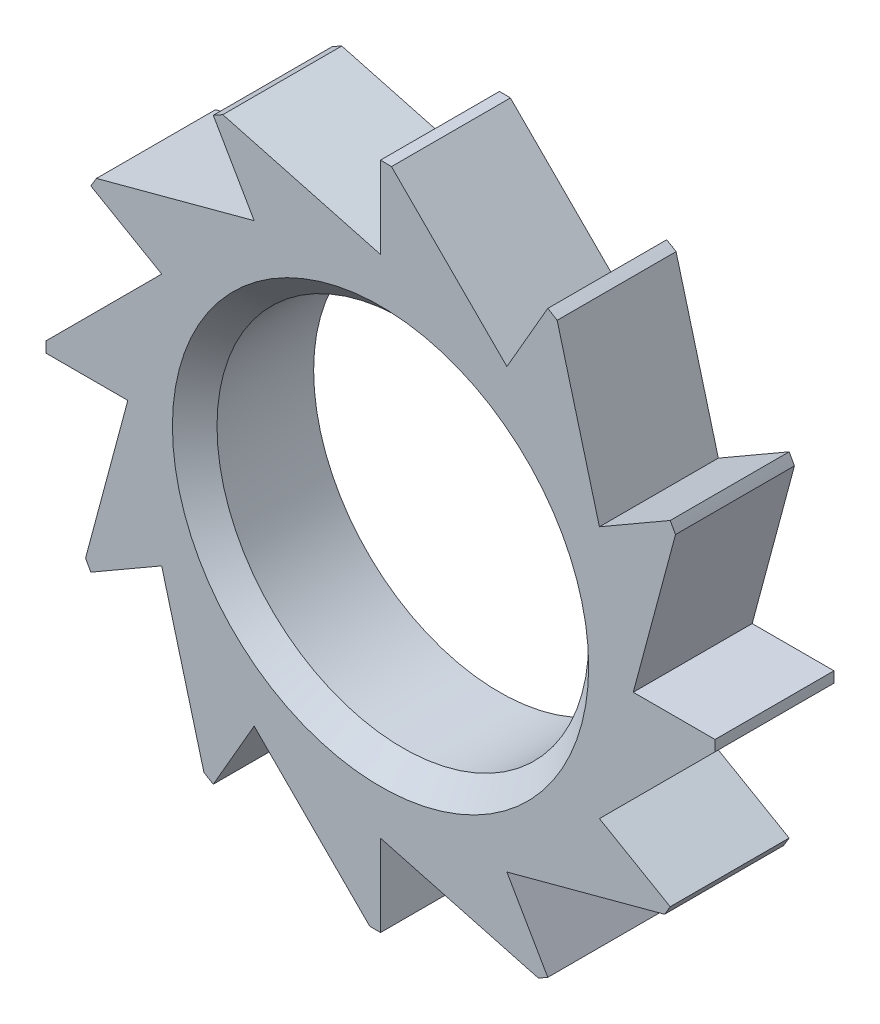
ISO-10303-21;
HEADER;
FILE_DESCRIPTION(('STEP AP214'),'2;1');
FILE_NAME('part.step','',(''),(''),'','','');
FILE_SCHEMA(('AUTOMOTIVE_DESIGN { 1 0 10303 214 1 1 1 1 }'));
ENDSEC;
DATA;
#1=APPLICATION_CONTEXT('core data for automotive mechanical design processes');
#2=APPLICATION_PROTOCOL_DEFINITION('international standard','automotive_design',2000,#1);
#3=PRODUCT_CONTEXT('',#1,'mechanical');
#4=PRODUCT('Part','Part','',(#3));
#5=PRODUCT_RELATED_PRODUCT_CATEGORY('part','',(#4));
#6=PRODUCT_DEFINITION_FORMATION('','',#4);
#7=PRODUCT_DEFINITION_CONTEXT('part definition',#1,'design');
#8=PRODUCT_DEFINITION('design','',#6,#7);
#9=PRODUCT_DEFINITION_SHAPE('','',#8);
#10=(LENGTH_UNIT() NAMED_UNIT(*) SI_UNIT(.MILLI.,.METRE.));
#11=(NAMED_UNIT(*) PLANE_ANGLE_UNIT() SI_UNIT($,.RADIAN.));
#12=(NAMED_UNIT(*) SI_UNIT($,.STERADIAN.) SOLID_ANGLE_UNIT());
#13=UNCERTAINTY_MEASURE_WITH_UNIT(LENGTH_MEASURE(1.E-05),#10,'distance_accuracy_value','');
#14=(GEOMETRIC_REPRESENTATION_CONTEXT(3) GLOBAL_UNCERTAINTY_ASSIGNED_CONTEXT((#13)) GLOBAL_UNIT_ASSIGNED_CONTEXT((#10,
#11,#12)) REPRESENTATION_CONTEXT('',''));
#15=CARTESIAN_POINT('',(0.,0.,0.));
#16=DIRECTION('',(0.,0.,1.));
#17=DIRECTION('',(1.,0.,0.));
#18=AXIS2_PLACEMENT_3D('',#15,#16,#17);
#19=CARTESIAN_POINT('',(0.,0.,8.));
#20=DIRECTION('',(0.,0.,-1.));
#21=DIRECTION('',(-1.,0.,0.));
#22=AXIS2_PLACEMENT_3D('',#19,#20,#21);
#23=CYLINDRICAL_SURFACE('',#22,45.);
#24=CARTESIAN_POINT('',(0.,0.,-8.));
#25=DIRECTION('',(0.,0.,1.));
#26=DIRECTION('',(1.,0.,0.));
#27=AXIS2_PLACEMENT_3D('',#24,#25,#26);
#28=CIRCLE('',#27,45.);
#29=CARTESIAN_POINT('',(-23.7600654655657,-38.2159559486876,-8.00000625));
#30=VERTEX_POINT('',#29);
#31=CARTESIAN_POINT('',(-22.4999999999998,-38.9711431702999,-8.00000625));
#32=VERTEX_POINT('',#31);
#33=EDGE_CURVE('E523',#30,#32,#28,.T.);
#34=ORIENTED_EDGE('',*,*,#33,.T.);
#35=DIRECTION('',(0.,0.,-1.));
#36=VECTOR('',#35,1.);
#37=CARTESIAN_POINT('',(-22.4999999999998,-38.9711431702999,8.));
#38=LINE('',#37,#36);
#39=CARTESIAN_POINT('',(-22.4999999999998,-38.9711431702999,8.));
#40=VERTEX_POINT('',#39);
#41=EDGE_CURVE('E11',#32,#40,#38,.F.);
#42=ORIENTED_EDGE('',*,*,#41,.T.);
#43=CARTESIAN_POINT('',(0.,0.,8.));
#44=DIRECTION('',(0.,0.,1.));
#45=DIRECTION('',(1.,0.,0.));
#46=AXIS2_PLACEMENT_3D('',#43,#44,#45);
#47=CIRCLE('',#46,45.);
#48=CARTESIAN_POINT('',(-23.7600654655657,-38.2159559486876,8.));
#49=VERTEX_POINT('',#48);
#50=EDGE_CURVE('E759',#49,#40,#47,.T.);
#51=ORIENTED_EDGE('',*,*,#50,.F.);
#52=DIRECTION('',(0.,0.,-1.));
#53=VECTOR('',#52,1.);
#54=CARTESIAN_POINT('',(-23.7600654655657,-38.2159559486876,8.));
#55=LINE('',#54,#53);
#56=EDGE_CURVE('E530',#49,#30,#55,.T.);
#57=ORIENTED_EDGE('',*,*,#56,.T.);
#58=EDGE_LOOP('',(#34,#42,#51,#57));
#59=FACE_BOUND('',#58,.T.);
#60=ADVANCED_FACE('F45',(#59),#23,.T.);
#61=CARTESIAN_POINT('',(-39.6847982631051,-21.2159559486876,-8.00000625));
#62=VERTEX_POINT('',#61);
#63=CARTESIAN_POINT('',(-38.9711431702996,-22.5000000000002,-8.00000625));
#64=VERTEX_POINT('',#63);
#65=EDGE_CURVE('E518',#62,#64,#28,.T.);
#66=ORIENTED_EDGE('',*,*,#65,.T.);
#67=DIRECTION('',(0.,0.,-1.));
#68=VECTOR('',#67,1.);
#69=CARTESIAN_POINT('',(-38.9711431702996,-22.5000000000002,8.));
#70=LINE('',#69,#68);
#71=CARTESIAN_POINT('',(-38.9711431702996,-22.5000000000002,8.));
#72=VERTEX_POINT('',#71);
#73=EDGE_CURVE('E537',#64,#72,#70,.F.);
#74=ORIENTED_EDGE('',*,*,#73,.T.);
#75=CARTESIAN_POINT('',(-39.6847982631051,-21.2159559486876,8.));
#76=VERTEX_POINT('',#75);
#77=EDGE_CURVE('E756',#76,#72,#47,.T.);
#78=ORIENTED_EDGE('',*,*,#77,.F.);
#79=DIRECTION('',(0.,0.,-1.));
#80=VECTOR('',#79,1.);
#81=CARTESIAN_POINT('',(-39.6847982631051,-21.2159559486876,8.));
#82=LINE('',#81,#80);
#83=EDGE_CURVE('E531',#76,#62,#82,.T.);
#84=ORIENTED_EDGE('',*,*,#83,.T.);
#85=EDGE_LOOP('',(#66,#74,#78,#84));
#86=FACE_BOUND('',#85,.T.);
#87=ADVANCED_FACE('F822',(#86),#23,.T.);
#88=CARTESIAN_POINT('',(-44.9760214142533,1.46884231441758,-8.00000625));
#89=VERTEX_POINT('',#88);
#90=CARTESIAN_POINT('',(-45.,-1.57116660247941E-13,-8.00000625));
#91=VERTEX_POINT('',#90);
#92=EDGE_CURVE('E463',#89,#91,#28,.T.);
#93=ORIENTED_EDGE('',*,*,#92,.T.);
#94=DIRECTION('',(0.,0.,-1.));
#95=VECTOR('',#94,1.);
#96=CARTESIAN_POINT('',(-45.,-1.57116660247941E-13,8.));
#97=LINE('',#96,#95);
#98=CARTESIAN_POINT('',(-45.,-1.57116660247941E-13,8.));
#99=VERTEX_POINT('',#98);
#100=EDGE_CURVE('E526',#91,#99,#97,.F.);
#101=ORIENTED_EDGE('',*,*,#100,.T.);
#102=CARTESIAN_POINT('',(-44.9760214142534,1.46884231441758,8.));
#103=VERTEX_POINT('',#102);
#104=EDGE_CURVE('E753',#103,#99,#47,.T.);
#105=ORIENTED_EDGE('',*,*,#104,.F.);
#106=DIRECTION('',(0.,0.,-1.));
#107=VECTOR('',#106,1.);
#108=CARTESIAN_POINT('',(-44.9760214142533,1.46884231441758,8.));
#109=LINE('',#108,#107);
#110=EDGE_CURVE('E896',#103,#89,#109,.T.);
#111=ORIENTED_EDGE('',*,*,#110,.T.);
#112=EDGE_LOOP('',(#93,#101,#105,#111));
#113=FACE_BOUND('',#112,.T.);
#114=ADVANCED_FACE('F827',(#113),#23,.T.);
#115=CARTESIAN_POINT('',(-38.2159559486875,23.7600654655659,-8.00000625));
#116=VERTEX_POINT('',#115);
#117=CARTESIAN_POINT('',(-38.9711431702998,22.4999999999999,-8.00000625));
#118=VERTEX_POINT('',#117);
#119=EDGE_CURVE('E312',#116,#118,#28,.T.);
#120=ORIENTED_EDGE('',*,*,#119,.T.);
#121=DIRECTION('',(0.,0.,-1.));
#122=VECTOR('',#121,1.);
#123=CARTESIAN_POINT('',(-38.9711431702998,22.4999999999999,8.));
#124=LINE('',#123,#122);
#125=CARTESIAN_POINT('',(-38.9711431702998,22.4999999999999,8.));
#126=VERTEX_POINT('',#125);
#127=EDGE_CURVE('E905',#118,#126,#124,.F.);
#128=ORIENTED_EDGE('',*,*,#127,.T.);
#129=CARTESIAN_POINT('',(-38.2159559486875,23.7600654655659,8.));
#130=VERTEX_POINT('',#129);
#131=EDGE_CURVE('E750',#130,#126,#47,.T.);
#132=ORIENTED_EDGE('',*,*,#131,.F.);
#133=DIRECTION('',(0.,0.,-1.));
#134=VECTOR('',#133,1.);
#135=CARTESIAN_POINT('',(-38.2159559486875,23.7600654655659,8.));
#136=LINE('',#135,#134);
#137=EDGE_CURVE('E453',#130,#116,#136,.T.);
#138=ORIENTED_EDGE('',*,*,#137,.T.);
#139=EDGE_LOOP('',(#120,#128,#132,#138));
#140=FACE_BOUND('',#139,.T.);
#141=ADVANCED_FACE('F1196',(#140),#23,.T.);
#142=CARTESIAN_POINT('',(21.2159559486874,-39.6847982631052,-8.00000625));
#143=VERTEX_POINT('',#142);
#144=CARTESIAN_POINT('',(22.5000000000003,-38.9711431702996,-8.00000625));
#145=VERTEX_POINT('',#144);
#146=EDGE_CURVE('E506',#143,#145,#28,.T.);
#147=ORIENTED_EDGE('',*,*,#146,.T.);
#148=DIRECTION('',(0.,0.,-1.));
#149=VECTOR('',#148,1.);
#150=CARTESIAN_POINT('',(22.5000000000003,-38.9711431702996,8.));
#151=LINE('',#150,#149);
#152=CARTESIAN_POINT('',(22.5000000000003,-38.9711431702996,8.));
#153=VERTEX_POINT('',#152);
#154=EDGE_CURVE('E893',#145,#153,#151,.F.);
#155=ORIENTED_EDGE('',*,*,#154,.T.);
#156=CARTESIAN_POINT('',(21.2159559486874,-39.6847982631052,8.));
#157=VERTEX_POINT('',#156);
#158=EDGE_CURVE('E764',#157,#153,#47,.T.);
#159=ORIENTED_EDGE('',*,*,#158,.F.);
#160=DIRECTION('',(0.,0.,-1.));
#161=VECTOR('',#160,1.);
#162=CARTESIAN_POINT('',(21.2159559486874,-39.6847982631052,8.));
#163=LINE('',#162,#161);
#164=EDGE_CURVE('E882',#157,#143,#163,.T.);
#165=ORIENTED_EDGE('',*,*,#164,.T.);
#166=EDGE_LOOP('',(#147,#155,#159,#165));
#167=FACE_BOUND('',#166,.T.);
#168=ADVANCED_FACE('F1204',(#167),#23,.T.);
#169=CARTESIAN_POINT('',(-1.46884231441742,-44.9760214142534,8.));
#170=VERTEX_POINT('',#169);
#171=CARTESIAN_POINT('',(0.,-45.,8.));
#172=VERTEX_POINT('',#171);
#173=EDGE_CURVE('E558',#170,#172,#47,.T.);
#174=ORIENTED_EDGE('',*,*,#173,.F.);
#175=DIRECTION('',(0.,0.,-1.));
#176=VECTOR('',#175,1.);
#177=CARTESIAN_POINT('',(-1.46884231441743,-44.9760214142533,8.));
#178=LINE('',#177,#176);
#179=CARTESIAN_POINT('',(-1.46884231441742,-44.9760214142534,-8.00000625));
#180=VERTEX_POINT('',#179);
#181=EDGE_CURVE('E56',#170,#180,#178,.T.);
#182=ORIENTED_EDGE('',*,*,#181,.T.);
#183=CARTESIAN_POINT('',(0.,-45.,-8.00000625));
#184=VERTEX_POINT('',#183);
#185=EDGE_CURVE('E511',#180,#184,#28,.T.);
#186=ORIENTED_EDGE('',*,*,#185,.T.);
#187=DIRECTION('',(0.,0.,-1.));
#188=VECTOR('',#187,1.);
#189=CARTESIAN_POINT('',(0.,-45.,8.));
#190=LINE('',#189,#188);
#191=EDGE_CURVE('E888',#184,#172,#190,.F.);
#192=ORIENTED_EDGE('',*,*,#191,.T.);
#193=EDGE_LOOP('',(#174,#182,#186,#192));
#194=FACE_BOUND('',#193,.T.);
#195=ADVANCED_FACE('F555',(#194),#23,.T.);
#196=CARTESIAN_POINT('',(38.2159559486877,-23.7600654655656,8.));
#197=VERTEX_POINT('',#196);
#198=CARTESIAN_POINT('',(38.9711431702999,-22.4999999999996,8.));
#199=VERTEX_POINT('',#198);
#200=EDGE_CURVE('E739',#197,#199,#47,.T.);
#201=ORIENTED_EDGE('',*,*,#200,.F.);
#202=DIRECTION('',(0.,0.,-1.));
#203=VECTOR('',#202,1.);
#204=CARTESIAN_POINT('',(38.2159559486877,-23.7600654655656,8.));
#205=LINE('',#204,#203);
#206=CARTESIAN_POINT('',(38.2159559486877,-23.7600654655656,-8.00000625));
#207=VERTEX_POINT('',#206);
#208=EDGE_CURVE('E890',#197,#207,#205,.T.);
#209=ORIENTED_EDGE('',*,*,#208,.T.);
#210=CARTESIAN_POINT('',(38.9711431702999,-22.4999999999996,-8.00000625));
#211=VERTEX_POINT('',#210);
#212=EDGE_CURVE('E501',#207,#211,#28,.T.);
#213=ORIENTED_EDGE('',*,*,#212,.T.);
#214=DIRECTION('',(0.,0.,-1.));
#215=VECTOR('',#214,1.);
#216=CARTESIAN_POINT('',(38.9711431702999,-22.4999999999996,8.));
#217=LINE('',#216,#215);
#218=EDGE_CURVE('E880',#211,#199,#217,.F.);
#219=ORIENTED_EDGE('',*,*,#218,.T.);
#220=EDGE_LOOP('',(#201,#209,#213,#219));
#221=FACE_BOUND('',#220,.T.);
#222=ADVANCED_FACE('F1221',(#221),#23,.T.);
#223=CARTESIAN_POINT('',(44.9760214142534,-1.46884231441726,8.));
#224=VERTEX_POINT('',#223);
#225=CARTESIAN_POINT('',(45.,4.71349980743823E-13,8.));
#226=VERTEX_POINT('',#225);
#227=EDGE_CURVE('E733',#224,#226,#47,.T.);
#228=ORIENTED_EDGE('',*,*,#227,.F.);
#229=DIRECTION('',(0.,0.,-1.));
#230=VECTOR('',#229,1.);
#231=CARTESIAN_POINT('',(44.9760214142534,-1.46884231441727,8.));
#232=LINE('',#231,#230);
#233=CARTESIAN_POINT('',(44.9760214142534,-1.46884231441727,-8.00000625));
#234=VERTEX_POINT('',#233);
#235=EDGE_CURVE('E873',#224,#234,#232,.T.);
#236=ORIENTED_EDGE('',*,*,#235,.T.);
#237=CARTESIAN_POINT('',(45.,4.71349980743823E-13,-8.00000625));
#238=VERTEX_POINT('',#237);
#239=EDGE_CURVE('E496',#234,#238,#28,.T.);
#240=ORIENTED_EDGE('',*,*,#239,.T.);
#241=DIRECTION('',(0.,0.,-1.));
#242=VECTOR('',#241,1.);
#243=CARTESIAN_POINT('',(45.,4.71349980743823E-13,8.));
#244=LINE('',#243,#242);
#245=EDGE_CURVE('E871',#238,#226,#244,.F.);
#246=ORIENTED_EDGE('',*,*,#245,.T.);
#247=EDGE_LOOP('',(#228,#236,#240,#246));
#248=FACE_BOUND('',#247,.T.);
#249=ADVANCED_FACE('F1230',(#248),#23,.T.);
#250=CARTESIAN_POINT('',(39.6847982631049,21.2159559486878,8.));
#251=VERTEX_POINT('',#250);
#252=CARTESIAN_POINT('',(38.9711431702995,22.5000000000005,8.));
#253=VERTEX_POINT('',#252);
#254=EDGE_CURVE('E730',#251,#253,#47,.T.);
#255=ORIENTED_EDGE('',*,*,#254,.F.);
#256=DIRECTION('',(0.,0.,-1.));
#257=VECTOR('',#256,1.);
#258=CARTESIAN_POINT('',(39.6847982631049,21.2159559486878,8.));
#259=LINE('',#258,#257);
#260=CARTESIAN_POINT('',(39.6847982631049,21.2159559486878,-8.00000625));
#261=VERTEX_POINT('',#260);
#262=EDGE_CURVE('E865',#251,#261,#259,.T.);
#263=ORIENTED_EDGE('',*,*,#262,.T.);
#264=CARTESIAN_POINT('',(38.9711431702995,22.5000000000005,-8.00000625));
#265=VERTEX_POINT('',#264);
#266=EDGE_CURVE('E491',#261,#265,#28,.T.);
#267=ORIENTED_EDGE('',*,*,#266,.T.);
#268=DIRECTION('',(0.,0.,-1.));
#269=VECTOR('',#268,1.);
#270=CARTESIAN_POINT('',(38.9711431702995,22.5000000000004,8.));
#271=LINE('',#270,#269);
#272=EDGE_CURVE('E862',#265,#253,#271,.F.);
#273=ORIENTED_EDGE('',*,*,#272,.T.);
#274=EDGE_LOOP('',(#255,#263,#267,#273));
#275=FACE_BOUND('',#274,.T.);
#276=ADVANCED_FACE('F844',(#275),#23,.T.);
#277=CARTESIAN_POINT('',(23.7600654655655,38.2159559486877,8.));
#278=VERTEX_POINT('',#277);
#279=CARTESIAN_POINT('',(22.4999999999995,38.9711431703,8.));
#280=VERTEX_POINT('',#279);
#281=EDGE_CURVE('E734',#278,#280,#47,.T.);
#282=ORIENTED_EDGE('',*,*,#281,.F.);
#283=DIRECTION('',(0.,0.,-1.));
#284=VECTOR('',#283,1.);
#285=CARTESIAN_POINT('',(23.7600654655655,38.2159559486877,8.));
#286=LINE('',#285,#284);
#287=CARTESIAN_POINT('',(23.7600654655655,38.2159559486877,-8.00000625));
#288=VERTEX_POINT('',#287);
#289=EDGE_CURVE('E859',#278,#288,#286,.T.);
#290=ORIENTED_EDGE('',*,*,#289,.T.);
#291=CARTESIAN_POINT('',(22.4999999999995,38.9711431703,-8.00000625));
#292=VERTEX_POINT('',#291);
#293=EDGE_CURVE('E486',#288,#292,#28,.T.);
#294=ORIENTED_EDGE('',*,*,#293,.T.);
#295=DIRECTION('',(0.,0.,-1.));
#296=VECTOR('',#295,1.);
#297=CARTESIAN_POINT('',(22.4999999999995,38.9711431703,8.));
#298=LINE('',#297,#296);
#299=EDGE_CURVE('E854',#292,#280,#298,.F.);
#300=ORIENTED_EDGE('',*,*,#299,.T.);
#301=EDGE_LOOP('',(#282,#290,#294,#300));
#302=FACE_BOUND('',#301,.T.);
#303=ADVANCED_FACE('F837',(#302),#23,.T.);
#304=CARTESIAN_POINT('',(-21.2159559486874,39.6847982631052,-8.));
#305=VERTEX_POINT('',#304);
#306=CARTESIAN_POINT('',(-22.5,38.9711431702997,-8.00000625));
#307=VERTEX_POINT('',#306);
#308=EDGE_CURVE('E462',#305,#307,#28,.T.);
#309=ORIENTED_EDGE('',*,*,#308,.T.);
#310=DIRECTION('',(0.,0.,-1.));
#311=VECTOR('',#310,1.);
#312=CARTESIAN_POINT('',(-22.5,38.9711431702997,8.));
#313=LINE('',#312,#311);
#314=CARTESIAN_POINT('',(-22.5,38.9711431702997,8.));
#315=VERTEX_POINT('',#314);
#316=EDGE_CURVE('E289',#307,#315,#313,.F.);
#317=ORIENTED_EDGE('',*,*,#316,.T.);
#318=CARTESIAN_POINT('',(-21.2159559486874,39.6847982631052,8.));
#319=VERTEX_POINT('',#318);
#320=EDGE_CURVE('E744',#319,#315,#47,.T.);
#321=ORIENTED_EDGE('',*,*,#320,.F.);
#322=DIRECTION('',(0.,0.,1.));
#323=VECTOR('',#322,1.);
#324=CARTESIAN_POINT('',(-21.2159559486874,39.6847982631052,-8.));
#325=LINE('',#324,#323);
#326=EDGE_CURVE('E617',#305,#319,#325,.T.);
#327=ORIENTED_EDGE('',*,*,#326,.F.);
#328=EDGE_LOOP('',(#309,#317,#321,#327));
#329=FACE_BOUND('',#328,.T.);
#330=ADVANCED_FACE('F831',(#329),#23,.T.);
#331=CARTESIAN_POINT('',(0.,0.,8.));
#332=DIRECTION('',(0.,0.,1.));
#333=DIRECTION('',(1.,0.,0.));
#334=AXIS2_PLACEMENT_3D('',#331,#332,#333);
#335=PLANE('',#334);
#336=DIRECTION('',(-0.499999999999995,-0.866025403784442,0.));
#337=VECTOR('',#336,1.);
#338=CARTESIAN_POINT('',(0.,0.,8.));
#339=LINE('',#338,#337);
#340=CARTESIAN_POINT('',(-16.9999999999998,-29.444863728671,8.));
#341=VERTEX_POINT('',#340);
#342=EDGE_CURVE('E319',#341,#40,#339,.T.);
#343=ORIENTED_EDGE('',*,*,#342,.F.);
#344=DIRECTION('',(-0.707106781186549,0.707106781186546,0.));
#345=VECTOR('',#344,1.);
#346=CARTESIAN_POINT('',(-23.2224318643354,-23.2224318643355,8.));
#347=LINE('',#346,#345);
#348=EDGE_CURVE('E446',#170,#341,#347,.T.);
#349=ORIENTED_EDGE('',*,*,#348,.F.);
#350=ORIENTED_EDGE('',*,*,#173,.T.);
#351=DIRECTION('',(0.,-1.,0.));
#352=VECTOR('',#351,1.);
#353=CARTESIAN_POINT('',(0.,0.,8.));
#354=LINE('',#353,#352);
#355=CARTESIAN_POINT('',(0.,-34.,8.));
#356=VERTEX_POINT('',#355);
#357=EDGE_CURVE('E391',#356,#172,#354,.T.);
#358=ORIENTED_EDGE('',*,*,#357,.F.);
#359=DIRECTION('',(-0.965925826289067,0.258819045102525,0.));
#360=VECTOR('',#359,1.);
#361=CARTESIAN_POINT('',(-8.50000000000012,-31.7224318643354,8.));
#362=LINE('',#361,#360);
#363=EDGE_CURVE('E385',#157,#356,#362,.T.);
#364=ORIENTED_EDGE('',*,*,#363,.F.);
#365=ORIENTED_EDGE('',*,*,#158,.T.);
#366=DIRECTION('',(0.500000000000007,-0.866025403784434,0.));
#367=VECTOR('',#366,1.);
#368=CARTESIAN_POINT('',(0.,0.,8.));
#369=LINE('',#368,#367);
#370=CARTESIAN_POINT('',(17.0000000000002,-29.4448637286708,8.));
#371=VERTEX_POINT('',#370);
#372=EDGE_CURVE('E412',#371,#153,#369,.T.);
#373=ORIENTED_EDGE('',*,*,#372,.F.);
#374=DIRECTION('',(-0.965925826289067,-0.258819045102525,0.));
#375=VECTOR('',#374,1.);
#376=CARTESIAN_POINT('',(8.50000000000012,-31.7224318643354,8.));
#377=LINE('',#376,#375);
#378=EDGE_CURVE('E396',#197,#371,#377,.T.);
#379=ORIENTED_EDGE('',*,*,#378,.F.);
#380=ORIENTED_EDGE('',*,*,#200,.T.);
#381=DIRECTION('',(0.866025403784443,-0.499999999999992,0.));
#382=VECTOR('',#381,1.);
#383=CARTESIAN_POINT('',(0.,0.,8.));
#384=LINE('',#383,#382);
#385=CARTESIAN_POINT('',(29.4448637286711,-16.9999999999997,8.));
#386=VERTEX_POINT('',#385);
#387=EDGE_CURVE('E386',#386,#199,#384,.T.);
#388=ORIENTED_EDGE('',*,*,#387,.F.);
#389=DIRECTION('',(-0.707106781186544,-0.707106781186551,0.));
#390=VECTOR('',#389,1.);
#391=CARTESIAN_POINT('',(23.2224318643355,-23.2224318643353,8.));
#392=LINE('',#391,#390);
#393=EDGE_CURVE('E370',#224,#386,#392,.T.);
#394=ORIENTED_EDGE('',*,*,#393,.F.);
#395=ORIENTED_EDGE('',*,*,#227,.T.);
#396=DIRECTION('',(1.,0.,0.));
#397=VECTOR('',#396,1.);
#398=CARTESIAN_POINT('',(0.,0.,8.));
#399=LINE('',#398,#397);
#400=CARTESIAN_POINT('',(34.,3.54783985082937E-13,8.));
#401=VERTEX_POINT('',#400);
#402=EDGE_CURVE('E365',#401,#226,#399,.T.);
#403=ORIENTED_EDGE('',*,*,#402,.F.);
#404=DIRECTION('',(-0.258819045102515,-0.96592582628907,0.));
#405=VECTOR('',#404,1.);
#406=CARTESIAN_POINT('',(31.7224318643355,-8.49999999999979,8.));
#407=LINE('',#406,#405);
#408=EDGE_CURVE('E359',#251,#401,#407,.T.);
#409=ORIENTED_EDGE('',*,*,#408,.F.);
#410=ORIENTED_EDGE('',*,*,#254,.T.);
#411=DIRECTION('',(0.866025403784433,0.50000000000001,0.));
#412=VECTOR('',#411,1.);
#413=CARTESIAN_POINT('',(0.,0.,8.));
#414=LINE('',#413,#412);
#415=CARTESIAN_POINT('',(29.4448637286707,17.0000000000003,8.));
#416=VERTEX_POINT('',#415);
#417=EDGE_CURVE('E360',#416,#253,#414,.T.);
#418=ORIENTED_EDGE('',*,*,#417,.F.);
#419=DIRECTION('',(0.258819045102528,-0.965925826289066,0.));
#420=VECTOR('',#419,1.);
#421=CARTESIAN_POINT('',(31.7224318643353,8.50000000000022,8.));
#422=LINE('',#421,#420);
#423=EDGE_CURVE('E344',#278,#416,#422,.T.);
#424=ORIENTED_EDGE('',*,*,#423,.F.);
#425=ORIENTED_EDGE('',*,*,#281,.T.);
#426=DIRECTION('',(0.499999999999989,0.866025403784445,0.));
#427=VECTOR('',#426,1.);
#428=CARTESIAN_POINT('',(0.,0.,8.));
#429=LINE('',#428,#427);
#430=CARTESIAN_POINT('',(16.9999999999996,29.4448637286711,8.));
#431=VERTEX_POINT('',#430);
#432=EDGE_CURVE('E341',#431,#280,#429,.T.);
#433=ORIENTED_EDGE('',*,*,#432,.F.);
#434=DIRECTION('',(0.707106781186554,-0.707106781186541,0.));
#435=VECTOR('',#434,1.);
#436=CARTESIAN_POINT('',(23.2224318643352,23.2224318643356,8.));
#437=LINE('',#436,#435);
#438=CARTESIAN_POINT('',(1.4688423144171,44.9760214142534,8.));
#439=VERTEX_POINT('',#438);
#440=EDGE_CURVE('E336',#439,#431,#437,.T.);
#441=ORIENTED_EDGE('',*,*,#440,.F.);
#442=CARTESIAN_POINT('',(0.,45.,8.000006));
#443=VERTEX_POINT('',#442);
#444=EDGE_CURVE('E325',#439,#443,#47,.T.);
#445=ORIENTED_EDGE('',*,*,#444,.T.);
#446=DIRECTION('',(0.,1.,0.));
#447=VECTOR('',#446,1.);
#448=CARTESIAN_POINT('',(0.,0.,8.));
#449=LINE('',#448,#447);
#450=CARTESIAN_POINT('',(0.,34.,8.));
#451=VERTEX_POINT('',#450);
#452=EDGE_CURVE('E599',#451,#443,#449,.T.);
#453=ORIENTED_EDGE('',*,*,#452,.F.);
#454=DIRECTION('',(0.965925826289067,-0.258819045102525,0.));
#455=VECTOR('',#454,1.);
#456=CARTESIAN_POINT('',(8.50000000000012,31.7224318643354,8.));
#457=LINE('',#456,#455);
#458=EDGE_CURVE('E603',#319,#451,#457,.T.);
#459=ORIENTED_EDGE('',*,*,#458,.F.);
#460=ORIENTED_EDGE('',*,*,#320,.T.);
#461=DIRECTION('',(-0.500000000000001,0.866025403784438,0.));
#462=VECTOR('',#461,1.);
#463=CARTESIAN_POINT('',(0.,0.,8.));
#464=LINE('',#463,#462);
#465=CARTESIAN_POINT('',(-17.,29.4448637286709,8.));
#466=VERTEX_POINT('',#465);
#467=EDGE_CURVE('E295',#466,#315,#464,.T.);
#468=ORIENTED_EDGE('',*,*,#467,.F.);
#469=DIRECTION('',(0.965925826289069,0.258819045102518,0.));
#470=VECTOR('',#469,1.);
#471=CARTESIAN_POINT('',(-8.49999999999989,31.7224318643354,8.));
#472=LINE('',#471,#470);
#473=EDGE_CURVE('E296',#130,#466,#472,.T.);
#474=ORIENTED_EDGE('',*,*,#473,.F.);
#475=ORIENTED_EDGE('',*,*,#131,.T.);
#476=DIRECTION('',(-0.86602540378444,0.499999999999998,0.));
#477=VECTOR('',#476,1.);
#478=CARTESIAN_POINT('',(0.,0.,8.));
#479=LINE('',#478,#477);
#480=CARTESIAN_POINT('',(-29.4448637286709,16.9999999999999,8.));
#481=VERTEX_POINT('',#480);
#482=EDGE_CURVE('E416',#481,#126,#479,.T.);
#483=ORIENTED_EDGE('',*,*,#482,.F.);
#484=DIRECTION('',(0.707106781186549,0.707106781186546,0.));
#485=VECTOR('',#484,1.);
#486=CARTESIAN_POINT('',(-23.2224318643354,23.2224318643355,8.));
#487=LINE('',#486,#485);
#488=EDGE_CURVE('E411',#103,#481,#487,.T.);
#489=ORIENTED_EDGE('',*,*,#488,.F.);
#490=ORIENTED_EDGE('',*,*,#104,.T.);
#491=DIRECTION('',(-1.,0.,0.));
#492=VECTOR('',#491,1.);
#493=CARTESIAN_POINT('',(0.,0.,8.));
#494=LINE('',#493,#492);
#495=CARTESIAN_POINT('',(-34.,-1.17363254041604E-13,8.));
#496=VERTEX_POINT('',#495);
#497=EDGE_CURVE('E437',#496,#99,#494,.T.);
#498=ORIENTED_EDGE('',*,*,#497,.F.);
#499=DIRECTION('',(0.258819045102521,0.965925826289068,0.));
#500=VECTOR('',#499,1.);
#501=CARTESIAN_POINT('',(-31.7224318643354,8.50000000000001,8.));
#502=LINE('',#501,#500);
#503=EDGE_CURVE('E421',#76,#496,#502,.T.);
#504=ORIENTED_EDGE('',*,*,#503,.F.);
#505=ORIENTED_EDGE('',*,*,#77,.T.);
#506=DIRECTION('',(-0.866025403784436,-0.500000000000004,0.));
#507=VECTOR('',#506,1.);
#508=CARTESIAN_POINT('',(0.,0.,8.));
#509=LINE('',#508,#507);
#510=CARTESIAN_POINT('',(-29.4448637286708,-17.0000000000001,8.));
#511=VERTEX_POINT('',#510);
#512=EDGE_CURVE('E442',#511,#72,#509,.T.);
#513=ORIENTED_EDGE('',*,*,#512,.F.);
#514=DIRECTION('',(-0.258819045102521,0.965925826289068,0.));
#515=VECTOR('',#514,1.);
#516=CARTESIAN_POINT('',(-31.7224318643354,-8.5,8.));
#517=LINE('',#516,#515);
#518=EDGE_CURVE('E436',#49,#511,#517,.T.);
#519=ORIENTED_EDGE('',*,*,#518,.F.);
#520=ORIENTED_EDGE('',*,*,#50,.T.);
#521=EDGE_LOOP('',(#343,#349,#350,#358,#364,#365,#373,#379,#380,#388,#394,#395,#403,#409,#410,
#418,#424,#425,#433,#441,#445,#453,#459,#460,#468,#474,#475,#483,#489,#490,#498,#504,#505,#513,
#519,#520));
#522=FACE_BOUND('',#521,.T.);
#523=CARTESIAN_POINT('',(0.,0.,8.));
#524=DIRECTION('',(0.,0.,1.));
#525=DIRECTION('',(1.,0.,0.));
#526=AXIS2_PLACEMENT_3D('',#523,#524,#525);
#527=CIRCLE('',#526,28.);
#528=CARTESIAN_POINT('',(28.,0.,8.));
#529=VERTEX_POINT('',#528);
#530=EDGE_CURVE('E456',#529,#529,#527,.F.);
#531=ORIENTED_EDGE('',*,*,#530,.T.);
#532=EDGE_LOOP('',(#531));
#533=FACE_BOUND('',#532,.T.);
#534=ADVANCED_FACE('F724',(#522,#533),#335,.T.);
#535=CARTESIAN_POINT('',(0.,0.,-8.));
#536=DIRECTION('',(0.,0.,1.));
#537=DIRECTION('',(1.,0.,0.));
#538=AXIS2_PLACEMENT_3D('',#535,#536,#537);
#539=PLANE('',#538);
#540=DIRECTION('',(-0.707106781186549,0.707106781186546,0.));
#541=VECTOR('',#540,1.);
#542=CARTESIAN_POINT('',(-23.2224318643354,-23.2224318643355,-8.));
#543=LINE('',#542,#541);
#544=CARTESIAN_POINT('',(-16.9999999999998,-29.444863728671,-8.));
#545=VERTEX_POINT('',#544);
#546=EDGE_CURVE('E443',#180,#545,#543,.T.);
#547=ORIENTED_EDGE('',*,*,#546,.T.);
#548=DIRECTION('',(-0.499999999999995,-0.866025403784442,0.));
#549=VECTOR('',#548,1.);
#550=CARTESIAN_POINT('',(0.,0.,-8.));
#551=LINE('',#550,#549);
#552=EDGE_CURVE('E447',#545,#32,#551,.T.);
#553=ORIENTED_EDGE('',*,*,#552,.T.);
#554=ORIENTED_EDGE('',*,*,#33,.F.);
#555=DIRECTION('',(-0.258819045102521,0.965925826289068,0.));
#556=VECTOR('',#555,1.);
#557=CARTESIAN_POINT('',(-31.7224318643354,-8.5,-8.));
#558=LINE('',#557,#556);
#559=CARTESIAN_POINT('',(-29.4448637286708,-17.0000000000001,-8.));
#560=VERTEX_POINT('',#559);
#561=EDGE_CURVE('E432',#30,#560,#558,.T.);
#562=ORIENTED_EDGE('',*,*,#561,.T.);
#563=DIRECTION('',(-0.866025403784436,-0.500000000000004,0.));
#564=VECTOR('',#563,1.);
#565=CARTESIAN_POINT('',(0.,0.,-8.));
#566=LINE('',#565,#564);
#567=EDGE_CURVE('E438',#560,#64,#566,.T.);
#568=ORIENTED_EDGE('',*,*,#567,.T.);
#569=ORIENTED_EDGE('',*,*,#65,.F.);
#570=DIRECTION('',(0.258819045102521,0.965925826289068,0.));
#571=VECTOR('',#570,1.);
#572=CARTESIAN_POINT('',(-31.7224318643354,8.50000000000001,-8.));
#573=LINE('',#572,#571);
#574=CARTESIAN_POINT('',(-34.,-1.17363254041604E-13,-8.));
#575=VERTEX_POINT('',#574);
#576=EDGE_CURVE('E417',#62,#575,#573,.T.);
#577=ORIENTED_EDGE('',*,*,#576,.T.);
#578=DIRECTION('',(-1.,0.,0.));
#579=VECTOR('',#578,1.);
#580=CARTESIAN_POINT('',(0.,0.,-8.));
#581=LINE('',#580,#579);
#582=EDGE_CURVE('E422',#575,#91,#581,.T.);
#583=ORIENTED_EDGE('',*,*,#582,.T.);
#584=ORIENTED_EDGE('',*,*,#92,.F.);
#585=DIRECTION('',(0.707106781186549,0.707106781186546,0.));
#586=VECTOR('',#585,1.);
#587=CARTESIAN_POINT('',(-23.2224318643354,23.2224318643355,-8.));
#588=LINE('',#587,#586);
#589=CARTESIAN_POINT('',(-29.4448637286709,16.9999999999999,-8.));
#590=VERTEX_POINT('',#589);
#591=EDGE_CURVE('E407',#89,#590,#588,.T.);
#592=ORIENTED_EDGE('',*,*,#591,.T.);
#593=DIRECTION('',(-0.86602540378444,0.499999999999998,0.));
#594=VECTOR('',#593,1.);
#595=CARTESIAN_POINT('',(0.,0.,-8.));
#596=LINE('',#595,#594);
#597=EDGE_CURVE('E413',#590,#118,#596,.T.);
#598=ORIENTED_EDGE('',*,*,#597,.T.);
#599=ORIENTED_EDGE('',*,*,#119,.F.);
#600=DIRECTION('',(0.965925826289069,0.258819045102518,0.));
#601=VECTOR('',#600,1.);
#602=CARTESIAN_POINT('',(-8.49999999999989,31.7224318643354,-8.));
#603=LINE('',#602,#601);
#604=CARTESIAN_POINT('',(-17.,29.4448637286709,-8.));
#605=VERTEX_POINT('',#604);
#606=EDGE_CURVE('E300',#116,#605,#603,.T.);
#607=ORIENTED_EDGE('',*,*,#606,.T.);
#608=DIRECTION('',(-0.500000000000001,0.866025403784438,0.));
#609=VECTOR('',#608,1.);
#610=CARTESIAN_POINT('',(0.,0.,-8.));
#611=LINE('',#610,#609);
#612=EDGE_CURVE('E283',#605,#307,#611,.T.);
#613=ORIENTED_EDGE('',*,*,#612,.T.);
#614=ORIENTED_EDGE('',*,*,#308,.F.);
#615=DIRECTION('',(0.965925826289067,-0.258819045102525,0.));
#616=VECTOR('',#615,1.);
#617=CARTESIAN_POINT('',(0.,34.,-8.));
#618=LINE('',#617,#616);
#619=CARTESIAN_POINT('',(0.,34.,-8.));
#620=VERTEX_POINT('',#619);
#621=EDGE_CURVE('E630',#305,#620,#618,.T.);
#622=ORIENTED_EDGE('',*,*,#621,.T.);
#623=DIRECTION('',(0.,1.,0.));
#624=VECTOR('',#623,1.);
#625=CARTESIAN_POINT('',(0.,45.,-8.));
#626=LINE('',#625,#624);
#627=CARTESIAN_POINT('',(0.,45.,-8.));
#628=VERTEX_POINT('',#627);
#629=EDGE_CURVE('E621',#620,#628,#626,.T.);
#630=ORIENTED_EDGE('',*,*,#629,.T.);
#631=CARTESIAN_POINT('',(1.46884231441711,44.9760214142534,-8.00000625));
#632=VERTEX_POINT('',#631);
#633=EDGE_CURVE('E481',#632,#628,#28,.T.);
#634=ORIENTED_EDGE('',*,*,#633,.F.);
#635=DIRECTION('',(0.707106781186554,-0.707106781186541,0.));
#636=VECTOR('',#635,1.);
#637=CARTESIAN_POINT('',(23.2224318643352,23.2224318643356,-8.));
#638=LINE('',#637,#636);
#639=CARTESIAN_POINT('',(16.9999999999996,29.4448637286711,-8.));
#640=VERTEX_POINT('',#639);
#641=EDGE_CURVE('E63',#632,#640,#638,.T.);
#642=ORIENTED_EDGE('',*,*,#641,.T.);
#643=DIRECTION('',(0.499999999999989,0.866025403784445,0.));
#644=VECTOR('',#643,1.);
#645=CARTESIAN_POINT('',(0.,0.,-8.));
#646=LINE('',#645,#644);
#647=EDGE_CURVE('E337',#640,#292,#646,.T.);
#648=ORIENTED_EDGE('',*,*,#647,.T.);
#649=ORIENTED_EDGE('',*,*,#293,.F.);
#650=DIRECTION('',(0.258819045102528,-0.965925826289066,0.));
#651=VECTOR('',#650,1.);
#652=CARTESIAN_POINT('',(31.7224318643353,8.50000000000022,-8.));
#653=LINE('',#652,#651);
#654=CARTESIAN_POINT('',(29.4448637286707,17.0000000000003,-8.));
#655=VERTEX_POINT('',#654);
#656=EDGE_CURVE('E71',#288,#655,#653,.T.);
#657=ORIENTED_EDGE('',*,*,#656,.T.);
#658=DIRECTION('',(0.866025403784433,0.50000000000001,0.));
#659=VECTOR('',#658,1.);
#660=CARTESIAN_POINT('',(0.,0.,-8.));
#661=LINE('',#660,#659);
#662=EDGE_CURVE('E345',#655,#265,#661,.T.);
#663=ORIENTED_EDGE('',*,*,#662,.T.);
#664=ORIENTED_EDGE('',*,*,#266,.F.);
#665=DIRECTION('',(-0.258819045102515,-0.96592582628907,0.));
#666=VECTOR('',#665,1.);
#667=CARTESIAN_POINT('',(31.7224318643355,-8.49999999999979,-8.));
#668=LINE('',#667,#666);
#669=CARTESIAN_POINT('',(34.,3.54783985082937E-13,-8.));
#670=VERTEX_POINT('',#669);
#671=EDGE_CURVE('E355',#261,#670,#668,.T.);
#672=ORIENTED_EDGE('',*,*,#671,.T.);
#673=DIRECTION('',(1.,0.,0.));
#674=VECTOR('',#673,1.);
#675=CARTESIAN_POINT('',(0.,0.,-8.));
#676=LINE('',#675,#674);
#677=EDGE_CURVE('E361',#670,#238,#676,.T.);
#678=ORIENTED_EDGE('',*,*,#677,.T.);
#679=ORIENTED_EDGE('',*,*,#239,.F.);
#680=DIRECTION('',(-0.707106781186544,-0.707106781186551,0.));
#681=VECTOR('',#680,1.);
#682=CARTESIAN_POINT('',(23.2224318643355,-23.2224318643353,-8.));
#683=LINE('',#682,#681);
#684=CARTESIAN_POINT('',(29.4448637286711,-16.9999999999997,-8.));
#685=VERTEX_POINT('',#684);
#686=EDGE_CURVE('E366',#234,#685,#683,.T.);
#687=ORIENTED_EDGE('',*,*,#686,.T.);
#688=DIRECTION('',(0.866025403784443,-0.499999999999992,0.));
#689=VECTOR('',#688,1.);
#690=CARTESIAN_POINT('',(0.,0.,-8.));
#691=LINE('',#690,#689);
#692=EDGE_CURVE('E371',#685,#211,#691,.T.);
#693=ORIENTED_EDGE('',*,*,#692,.T.);
#694=ORIENTED_EDGE('',*,*,#212,.F.);
#695=DIRECTION('',(-0.965925826289067,-0.258819045102525,0.));
#696=VECTOR('',#695,1.);
#697=CARTESIAN_POINT('',(8.50000000000012,-31.7224318643354,-8.));
#698=LINE('',#697,#696);
#699=CARTESIAN_POINT('',(17.0000000000002,-29.4448637286708,-8.));
#700=VERTEX_POINT('',#699);
#701=EDGE_CURVE('E392',#207,#700,#698,.T.);
#702=ORIENTED_EDGE('',*,*,#701,.T.);
#703=DIRECTION('',(0.500000000000007,-0.866025403784434,0.));
#704=VECTOR('',#703,1.);
#705=CARTESIAN_POINT('',(0.,0.,-8.));
#706=LINE('',#705,#704);
#707=EDGE_CURVE('E397',#700,#145,#706,.T.);
#708=ORIENTED_EDGE('',*,*,#707,.T.);
#709=ORIENTED_EDGE('',*,*,#146,.F.);
#710=DIRECTION('',(-0.965925826289067,0.258819045102525,0.));
#711=VECTOR('',#710,1.);
#712=CARTESIAN_POINT('',(-8.50000000000012,-31.7224318643354,-8.));
#713=LINE('',#712,#711);
#714=CARTESIAN_POINT('',(0.,-34.,-8.));
#715=VERTEX_POINT('',#714);
#716=EDGE_CURVE('E381',#143,#715,#713,.T.);
#717=ORIENTED_EDGE('',*,*,#716,.T.);
#718=DIRECTION('',(0.,-1.,0.));
#719=VECTOR('',#718,1.);
#720=CARTESIAN_POINT('',(0.,0.,-8.));
#721=LINE('',#720,#719);
#722=EDGE_CURVE('E387',#715,#184,#721,.T.);
#723=ORIENTED_EDGE('',*,*,#722,.T.);
#724=ORIENTED_EDGE('',*,*,#185,.F.);
#725=EDGE_LOOP('',(#547,#553,#554,#562,#568,#569,#577,#583,#584,#592,#598,#599,#607,#613,#614,
#622,#630,#634,#642,#648,#649,#657,#663,#664,#672,#678,#679,#687,#693,#694,#702,#708,#709,#717,
#723,#724));
#726=FACE_BOUND('',#725,.T.);
#727=CARTESIAN_POINT('',(0.,0.,-8.));
#728=DIRECTION('',(0.,0.,1.));
#729=DIRECTION('',(1.,0.,0.));
#730=AXIS2_PLACEMENT_3D('',#727,#728,#729);
#731=CIRCLE('',#730,25.);
#732=CARTESIAN_POINT('',(25.,0.,-8.));
#733=VERTEX_POINT('',#732);
#734=EDGE_CURVE('E468',#733,#733,#731,.T.);
#735=ORIENTED_EDGE('',*,*,#734,.T.);
#736=EDGE_LOOP('',(#735));
#737=FACE_BOUND('',#736,.T.);
#738=ADVANCED_FACE('F308',(#726,#737),#539,.F.);
#739=ORIENTED_EDGE('',*,*,#444,.F.);
#740=DIRECTION('',(0.,0.,-1.));
#741=VECTOR('',#740,1.);
#742=CARTESIAN_POINT('',(1.46884231441712,44.9760214142534,8.));
#743=LINE('',#742,#741);
#744=EDGE_CURVE('E850',#439,#632,#743,.T.);
#745=ORIENTED_EDGE('',*,*,#744,.T.);
#746=ORIENTED_EDGE('',*,*,#633,.T.);
#747=DIRECTION('',(0.,0.,1.));
#748=VECTOR('',#747,1.);
#749=CARTESIAN_POINT('',(0.,45.,-8.));
#750=LINE('',#749,#748);
#751=EDGE_CURVE('E609',#628,#443,#750,.T.);
#752=ORIENTED_EDGE('',*,*,#751,.T.);
#753=EDGE_LOOP('',(#739,#745,#746,#752));
#754=FACE_BOUND('',#753,.T.);
#755=ADVANCED_FACE('F819',(#754),#23,.T.);
#756=CARTESIAN_POINT('',(0.,0.,8.));
#757=DIRECTION('',(0.,0.,-1.));
#758=DIRECTION('',(-1.,0.,0.));
#759=AXIS2_PLACEMENT_3D('',#756,#757,#758);
#760=CYLINDRICAL_SURFACE('',#759,25.);
#761=CARTESIAN_POINT('',(0.,0.,4.99999999999997));
#762=DIRECTION('',(0.,0.,1.));
#763=DIRECTION('',(1.,0.,0.));
#764=AXIS2_PLACEMENT_3D('',#761,#762,#763);
#765=CIRCLE('',#764,25.);
#766=CARTESIAN_POINT('',(25.,0.,4.99999999999997));
#767=VERTEX_POINT('',#766);
#768=EDGE_CURVE('E470',#767,#767,#765,.T.);
#769=ORIENTED_EDGE('',*,*,#768,.T.);
#770=EDGE_LOOP('',(#769));
#771=FACE_BOUND('',#770,.T.);
#772=ORIENTED_EDGE('',*,*,#734,.F.);
#773=EDGE_LOOP('',(#772));
#774=FACE_BOUND('',#773,.T.);
#775=ADVANCED_FACE('F812',(#771,#774),#760,.F.);
#776=CARTESIAN_POINT('',(0.,0.,4.99999999999997));
#777=DIRECTION('',(0.,0.,1.));
#778=DIRECTION('',(1.,0.,0.));
#779=AXIS2_PLACEMENT_3D('',#776,#777,#778);
#780=CONICAL_SURFACE('',#779,25.,0.785398163397448);
#781=ORIENTED_EDGE('',*,*,#530,.F.);
#782=EDGE_LOOP('',(#781));
#783=FACE_BOUND('',#782,.T.);
#784=ORIENTED_EDGE('',*,*,#768,.F.);
#785=EDGE_LOOP('',(#784));
#786=FACE_BOUND('',#785,.T.);
#787=ADVANCED_FACE('F48',(#783,#786),#780,.F.);
#788=CARTESIAN_POINT('',(0.,45.,-8.));
#789=DIRECTION('',(1.,0.,0.));
#790=DIRECTION('',(0.,1.,0.));
#791=AXIS2_PLACEMENT_3D('',#788,#789,#790);
#792=PLANE('',#791);
#793=ORIENTED_EDGE('',*,*,#452,.T.);
#794=ORIENTED_EDGE('',*,*,#751,.F.);
#795=ORIENTED_EDGE('',*,*,#629,.F.);
#796=DIRECTION('',(0.,0.,1.));
#797=VECTOR('',#796,1.);
#798=CARTESIAN_POINT('',(0.,34.,-8.));
#799=LINE('',#798,#797);
#800=EDGE_CURVE('E620',#620,#451,#799,.T.);
#801=ORIENTED_EDGE('',*,*,#800,.T.);
#802=EDGE_LOOP('',(#793,#794,#795,#801));
#803=FACE_BOUND('',#802,.T.);
#804=ADVANCED_FACE('F811',(#803),#792,.F.);
#805=CARTESIAN_POINT('',(0.,34.,-8.));
#806=DIRECTION('',(-0.258819045102525,-0.965925826289067,0.));
#807=DIRECTION('',(0.965925826289067,-0.258819045102525,0.));
#808=AXIS2_PLACEMENT_3D('',#805,#806,#807);
#809=PLANE('',#808);
#810=ORIENTED_EDGE('',*,*,#458,.T.);
#811=ORIENTED_EDGE('',*,*,#800,.F.);
#812=ORIENTED_EDGE('',*,*,#621,.F.);
#813=ORIENTED_EDGE('',*,*,#326,.T.);
#814=EDGE_LOOP('',(#810,#811,#812,#813));
#815=FACE_BOUND('',#814,.T.);
#816=ADVANCED_FACE('F817',(#815),#809,.F.);
#817=CARTESIAN_POINT('',(-22.5,38.9711431702997,-8.000025));
#818=DIRECTION('',(0.866025403784438,0.500000000000001,0.));
#819=DIRECTION('',(-0.500000000000001,0.866025403784438,0.));
#820=AXIS2_PLACEMENT_3D('',#817,#818,#819);
#821=PLANE('',#820);
#822=ORIENTED_EDGE('',*,*,#467,.T.);
#823=ORIENTED_EDGE('',*,*,#316,.F.);
#824=ORIENTED_EDGE('',*,*,#612,.F.);
#825=DIRECTION('',(0.,0.,1.));
#826=VECTOR('',#825,1.);
#827=CARTESIAN_POINT('',(-17.,29.4448637286709,-8.000025));
#828=LINE('',#827,#826);
#829=EDGE_CURVE('E286',#605,#466,#828,.T.);
#830=ORIENTED_EDGE('',*,*,#829,.T.);
#831=EDGE_LOOP('',(#822,#823,#824,#830));
#832=FACE_BOUND('',#831,.T.);
#833=ADVANCED_FACE('F285',(#832),#821,.F.);
#834=CARTESIAN_POINT('',(-17.,29.4448637286709,-8.000025));
#835=DIRECTION('',(0.258819045102518,-0.965925826289069,0.));
#836=DIRECTION('',(0.965925826289069,0.258819045102518,0.));
#837=AXIS2_PLACEMENT_3D('',#834,#835,#836);
#838=PLANE('',#837);
#839=ORIENTED_EDGE('',*,*,#473,.T.);
#840=ORIENTED_EDGE('',*,*,#829,.F.);
#841=ORIENTED_EDGE('',*,*,#606,.F.);
#842=ORIENTED_EDGE('',*,*,#137,.F.);
#843=EDGE_LOOP('',(#839,#840,#841,#842));
#844=FACE_BOUND('',#843,.T.);
#845=ADVANCED_FACE('F299',(#844),#838,.F.);
#846=CARTESIAN_POINT('',(22.4999999999995,38.9711431703,-8.000025));
#847=DIRECTION('',(0.866025403784445,-0.499999999999989,0.));
#848=DIRECTION('',(0.499999999999989,0.866025403784445,0.));
#849=AXIS2_PLACEMENT_3D('',#846,#847,#848);
#850=PLANE('',#849);
#851=ORIENTED_EDGE('',*,*,#432,.T.);
#852=ORIENTED_EDGE('',*,*,#299,.F.);
#853=ORIENTED_EDGE('',*,*,#647,.F.);
#854=DIRECTION('',(0.,0.,1.));
#855=VECTOR('',#854,1.);
#856=CARTESIAN_POINT('',(16.9999999999996,29.4448637286711,-8.000025));
#857=LINE('',#856,#855);
#858=EDGE_CURVE('E711',#640,#431,#857,.T.);
#859=ORIENTED_EDGE('',*,*,#858,.T.);
#860=EDGE_LOOP('',(#851,#852,#853,#859));
#861=FACE_BOUND('',#860,.T.);
#862=ADVANCED_FACE('F853',(#861),#850,.F.);
#863=CARTESIAN_POINT('',(16.9999999999996,29.4448637286711,-8.000025));
#864=DIRECTION('',(-0.707106781186541,-0.707106781186554,0.));
#865=DIRECTION('',(0.707106781186554,-0.707106781186541,0.));
#866=AXIS2_PLACEMENT_3D('',#863,#864,#865);
#867=PLANE('',#866);
#868=ORIENTED_EDGE('',*,*,#440,.T.);
#869=ORIENTED_EDGE('',*,*,#858,.F.);
#870=ORIENTED_EDGE('',*,*,#641,.F.);
#871=ORIENTED_EDGE('',*,*,#744,.F.);
#872=EDGE_LOOP('',(#868,#869,#870,#871));
#873=FACE_BOUND('',#872,.T.);
#874=ADVANCED_FACE('F855',(#873),#867,.F.);
#875=CARTESIAN_POINT('',(38.9711431702995,22.5000000000005,-8.000025));
#876=DIRECTION('',(0.50000000000001,-0.866025403784433,0.));
#877=DIRECTION('',(0.866025403784433,0.50000000000001,0.));
#878=AXIS2_PLACEMENT_3D('',#875,#876,#877);
#879=PLANE('',#878);
#880=ORIENTED_EDGE('',*,*,#417,.T.);
#881=ORIENTED_EDGE('',*,*,#272,.F.);
#882=ORIENTED_EDGE('',*,*,#662,.F.);
#883=DIRECTION('',(0.,0.,1.));
#884=VECTOR('',#883,1.);
#885=CARTESIAN_POINT('',(29.4448637286707,17.0000000000003,-8.000025));
#886=LINE('',#885,#884);
#887=EDGE_CURVE('E685',#655,#416,#886,.T.);
#888=ORIENTED_EDGE('',*,*,#887,.T.);
#889=EDGE_LOOP('',(#880,#881,#882,#888));
#890=FACE_BOUND('',#889,.T.);
#891=ADVANCED_FACE('F719',(#890),#879,.F.);
#892=CARTESIAN_POINT('',(29.4448637286707,17.0000000000003,-8.000025));
#893=DIRECTION('',(-0.965925826289066,-0.258819045102528,0.));
#894=DIRECTION('',(0.258819045102528,-0.965925826289066,0.));
#895=AXIS2_PLACEMENT_3D('',#892,#893,#894);
#896=PLANE('',#895);
#897=ORIENTED_EDGE('',*,*,#423,.T.);
#898=ORIENTED_EDGE('',*,*,#887,.F.);
#899=ORIENTED_EDGE('',*,*,#656,.F.);
#900=ORIENTED_EDGE('',*,*,#289,.F.);
#901=EDGE_LOOP('',(#897,#898,#899,#900));
#902=FACE_BOUND('',#901,.T.);
#903=ADVANCED_FACE('F978',(#902),#896,.F.);
#904=CARTESIAN_POINT('',(45.,4.71349980743823E-13,-8.000025));
#905=DIRECTION('',(0.,-1.,0.));
#906=DIRECTION('',(1.,0.,0.));
#907=AXIS2_PLACEMENT_3D('',#904,#905,#906);
#908=PLANE('',#907);
#909=ORIENTED_EDGE('',*,*,#402,.T.);
#910=ORIENTED_EDGE('',*,*,#245,.F.);
#911=ORIENTED_EDGE('',*,*,#677,.F.);
#912=DIRECTION('',(0.,0.,1.));
#913=VECTOR('',#912,1.);
#914=CARTESIAN_POINT('',(34.,3.54783985082937E-13,-8.000025));
#915=LINE('',#914,#913);
#916=EDGE_CURVE('E680',#670,#401,#915,.T.);
#917=ORIENTED_EDGE('',*,*,#916,.T.);
#918=EDGE_LOOP('',(#909,#910,#911,#917));
#919=FACE_BOUND('',#918,.T.);
#920=ADVANCED_FACE('F975',(#919),#908,.F.);
#921=CARTESIAN_POINT('',(34.,3.54783985082937E-13,-8.000025));
#922=DIRECTION('',(-0.96592582628907,0.258819045102515,0.));
#923=DIRECTION('',(-0.258819045102515,-0.96592582628907,0.));
#924=AXIS2_PLACEMENT_3D('',#921,#922,#923);
#925=PLANE('',#924);
#926=ORIENTED_EDGE('',*,*,#408,.T.);
#927=ORIENTED_EDGE('',*,*,#916,.F.);
#928=ORIENTED_EDGE('',*,*,#671,.F.);
#929=ORIENTED_EDGE('',*,*,#262,.F.);
#930=EDGE_LOOP('',(#926,#927,#928,#929));
#931=FACE_BOUND('',#930,.T.);
#932=ADVANCED_FACE('F970',(#931),#925,.F.);
#933=CARTESIAN_POINT('',(38.9711431702999,-22.4999999999996,-8.000025));
#934=DIRECTION('',(-0.499999999999992,-0.866025403784443,0.));
#935=DIRECTION('',(0.866025403784443,-0.499999999999992,0.));
#936=AXIS2_PLACEMENT_3D('',#933,#934,#935);
#937=PLANE('',#936);
#938=ORIENTED_EDGE('',*,*,#387,.T.);
#939=ORIENTED_EDGE('',*,*,#218,.F.);
#940=ORIENTED_EDGE('',*,*,#692,.F.);
#941=DIRECTION('',(0.,0.,1.));
#942=VECTOR('',#941,1.);
#943=CARTESIAN_POINT('',(29.4448637286711,-16.9999999999997,-8.000025));
#944=LINE('',#943,#942);
#945=EDGE_CURVE('E684',#685,#386,#944,.T.);
#946=ORIENTED_EDGE('',*,*,#945,.T.);
#947=EDGE_LOOP('',(#938,#939,#940,#946));
#948=FACE_BOUND('',#947,.T.);
#949=ADVANCED_FACE('F967',(#948),#937,.F.);
#950=CARTESIAN_POINT('',(29.4448637286711,-16.9999999999997,-8.000025));
#951=DIRECTION('',(-0.707106781186551,0.707106781186544,0.));
#952=DIRECTION('',(-0.707106781186544,-0.707106781186551,0.));
#953=AXIS2_PLACEMENT_3D('',#950,#951,#952);
#954=PLANE('',#953);
#955=ORIENTED_EDGE('',*,*,#393,.T.);
#956=ORIENTED_EDGE('',*,*,#945,.F.);
#957=ORIENTED_EDGE('',*,*,#686,.F.);
#958=ORIENTED_EDGE('',*,*,#235,.F.);
#959=EDGE_LOOP('',(#955,#956,#957,#958));
#960=FACE_BOUND('',#959,.T.);
#961=ADVANCED_FACE('F962',(#960),#954,.F.);
#962=CARTESIAN_POINT('',(0.,-45.,-8.000025));
#963=DIRECTION('',(-1.,0.,0.));
#964=DIRECTION('',(0.,-1.,0.));
#965=AXIS2_PLACEMENT_3D('',#962,#963,#964);
#966=PLANE('',#965);
#967=ORIENTED_EDGE('',*,*,#357,.T.);
#968=ORIENTED_EDGE('',*,*,#191,.F.);
#969=ORIENTED_EDGE('',*,*,#722,.F.);
#970=DIRECTION('',(0.,0.,1.));
#971=VECTOR('',#970,1.);
#972=CARTESIAN_POINT('',(0.,-34.,-8.000025));
#973=LINE('',#972,#971);
#974=EDGE_CURVE('E690',#715,#356,#973,.T.);
#975=ORIENTED_EDGE('',*,*,#974,.T.);
#976=EDGE_LOOP('',(#967,#968,#969,#975));
#977=FACE_BOUND('',#976,.T.);
#978=ADVANCED_FACE('F959',(#977),#966,.F.);
#979=CARTESIAN_POINT('',(0.,-34.,-8.000025));
#980=DIRECTION('',(0.258819045102525,0.965925826289067,0.));
#981=DIRECTION('',(-0.965925826289067,0.258819045102525,0.));
#982=AXIS2_PLACEMENT_3D('',#979,#980,#981);
#983=PLANE('',#982);
#984=ORIENTED_EDGE('',*,*,#363,.T.);
#985=ORIENTED_EDGE('',*,*,#974,.F.);
#986=ORIENTED_EDGE('',*,*,#716,.F.);
#987=ORIENTED_EDGE('',*,*,#164,.F.);
#988=EDGE_LOOP('',(#984,#985,#986,#987));
#989=FACE_BOUND('',#988,.T.);
#990=ADVANCED_FACE('F954',(#989),#983,.F.);
#991=CARTESIAN_POINT('',(22.5000000000003,-38.9711431702996,-8.000025));
#992=DIRECTION('',(-0.866025403784434,-0.500000000000007,0.));
#993=DIRECTION('',(0.500000000000007,-0.866025403784434,0.));
#994=AXIS2_PLACEMENT_3D('',#991,#992,#993);
#995=PLANE('',#994);
#996=ORIENTED_EDGE('',*,*,#372,.T.);
#997=ORIENTED_EDGE('',*,*,#154,.F.);
#998=ORIENTED_EDGE('',*,*,#707,.F.);
#999=DIRECTION('',(0.,0.,1.));
#1000=VECTOR('',#999,1.);
#1001=CARTESIAN_POINT('',(17.0000000000002,-29.4448637286708,-8.000025));
#1002=LINE('',#1001,#1000);
#1003=EDGE_CURVE('E689',#700,#371,#1002,.T.);
#1004=ORIENTED_EDGE('',*,*,#1003,.T.);
#1005=EDGE_LOOP('',(#996,#997,#998,#1004));
#1006=FACE_BOUND('',#1005,.T.);
#1007=ADVANCED_FACE('F951',(#1006),#995,.F.);
#1008=CARTESIAN_POINT('',(17.0000000000002,-29.4448637286708,-8.000025));
#1009=DIRECTION('',(-0.258819045102525,0.965925826289067,0.));
#1010=DIRECTION('',(-0.965925826289067,-0.258819045102525,0.));
#1011=AXIS2_PLACEMENT_3D('',#1008,#1009,#1010);
#1012=PLANE('',#1011);
#1013=ORIENTED_EDGE('',*,*,#378,.T.);
#1014=ORIENTED_EDGE('',*,*,#1003,.F.);
#1015=ORIENTED_EDGE('',*,*,#701,.F.);
#1016=ORIENTED_EDGE('',*,*,#208,.F.);
#1017=EDGE_LOOP('',(#1013,#1014,#1015,#1016));
#1018=FACE_BOUND('',#1017,.T.);
#1019=ADVANCED_FACE('F939',(#1018),#1012,.F.);
#1020=CARTESIAN_POINT('',(-38.9711431702998,22.4999999999999,-8.000025));
#1021=DIRECTION('',(0.499999999999998,0.86602540378444,0.));
#1022=DIRECTION('',(-0.86602540378444,0.499999999999998,0.));
#1023=AXIS2_PLACEMENT_3D('',#1020,#1021,#1022);
#1024=PLANE('',#1023);
#1025=ORIENTED_EDGE('',*,*,#482,.T.);
#1026=ORIENTED_EDGE('',*,*,#127,.F.);
#1027=ORIENTED_EDGE('',*,*,#597,.F.);
#1028=DIRECTION('',(0.,0.,1.));
#1029=VECTOR('',#1028,1.);
#1030=CARTESIAN_POINT('',(-29.4448637286709,16.9999999999999,-8.000025));
#1031=LINE('',#1030,#1029);
#1032=EDGE_CURVE('E304',#590,#481,#1031,.T.);
#1033=ORIENTED_EDGE('',*,*,#1032,.T.);
#1034=EDGE_LOOP('',(#1025,#1026,#1027,#1033));
#1035=FACE_BOUND('',#1034,.T.);
#1036=ADVANCED_FACE('F935',(#1035),#1024,.F.);
#1037=CARTESIAN_POINT('',(-29.4448637286709,16.9999999999999,-8.000025));
#1038=DIRECTION('',(0.707106781186546,-0.707106781186549,0.));
#1039=DIRECTION('',(0.707106781186549,0.707106781186546,0.));
#1040=AXIS2_PLACEMENT_3D('',#1037,#1038,#1039);
#1041=PLANE('',#1040);
#1042=ORIENTED_EDGE('',*,*,#488,.T.);
#1043=ORIENTED_EDGE('',*,*,#1032,.F.);
#1044=ORIENTED_EDGE('',*,*,#591,.F.);
#1045=ORIENTED_EDGE('',*,*,#110,.F.);
#1046=EDGE_LOOP('',(#1042,#1043,#1044,#1045));
#1047=FACE_BOUND('',#1046,.T.);
#1048=ADVANCED_FACE('F938',(#1047),#1041,.F.);
#1049=CARTESIAN_POINT('',(-45.,-1.57116660247941E-13,-8.000025));
#1050=DIRECTION('',(0.,1.,0.));
#1051=DIRECTION('',(-1.,0.,0.));
#1052=AXIS2_PLACEMENT_3D('',#1049,#1050,#1051);
#1053=PLANE('',#1052);
#1054=ORIENTED_EDGE('',*,*,#497,.T.);
#1055=ORIENTED_EDGE('',*,*,#100,.F.);
#1056=ORIENTED_EDGE('',*,*,#582,.F.);
#1057=DIRECTION('',(0.,0.,1.));
#1058=VECTOR('',#1057,1.);
#1059=CARTESIAN_POINT('',(-34.,-1.17363254041604E-13,-8.000025));
#1060=LINE('',#1059,#1058);
#1061=EDGE_CURVE('E698',#575,#496,#1060,.T.);
#1062=ORIENTED_EDGE('',*,*,#1061,.T.);
#1063=EDGE_LOOP('',(#1054,#1055,#1056,#1062));
#1064=FACE_BOUND('',#1063,.T.);
#1065=ADVANCED_FACE('F943',(#1064),#1053,.F.);
#1066=CARTESIAN_POINT('',(-34.,-1.17363254041604E-13,-8.000025));
#1067=DIRECTION('',(0.965925826289068,-0.258819045102521,0.));
#1068=DIRECTION('',(0.258819045102521,0.965925826289068,0.));
#1069=AXIS2_PLACEMENT_3D('',#1066,#1067,#1068);
#1070=PLANE('',#1069);
#1071=ORIENTED_EDGE('',*,*,#503,.T.);
#1072=ORIENTED_EDGE('',*,*,#1061,.F.);
#1073=ORIENTED_EDGE('',*,*,#576,.F.);
#1074=ORIENTED_EDGE('',*,*,#83,.F.);
#1075=EDGE_LOOP('',(#1071,#1072,#1073,#1074));
#1076=FACE_BOUND('',#1075,.T.);
#1077=ADVANCED_FACE('F947',(#1076),#1070,.F.);
#1078=CARTESIAN_POINT('',(-38.9711431702996,-22.5000000000002,-8.000025));
#1079=DIRECTION('',(-0.500000000000004,0.866025403784436,0.));
#1080=DIRECTION('',(-0.866025403784436,-0.500000000000004,0.));
#1081=AXIS2_PLACEMENT_3D('',#1078,#1079,#1080);
#1082=PLANE('',#1081);
#1083=ORIENTED_EDGE('',*,*,#512,.T.);
#1084=ORIENTED_EDGE('',*,*,#73,.F.);
#1085=ORIENTED_EDGE('',*,*,#567,.F.);
#1086=DIRECTION('',(0.,0.,1.));
#1087=VECTOR('',#1086,1.);
#1088=CARTESIAN_POINT('',(-29.4448637286708,-17.0000000000001,-8.000025));
#1089=LINE('',#1088,#1087);
#1090=EDGE_CURVE('E702',#560,#511,#1089,.T.);
#1091=ORIENTED_EDGE('',*,*,#1090,.T.);
#1092=EDGE_LOOP('',(#1083,#1084,#1085,#1091));
#1093=FACE_BOUND('',#1092,.T.);
#1094=ADVANCED_FACE('F922',(#1093),#1082,.F.);
#1095=CARTESIAN_POINT('',(-29.4448637286708,-17.0000000000001,-8.000025));
#1096=DIRECTION('',(0.965925826289068,0.258819045102521,0.));
#1097=DIRECTION('',(-0.258819045102521,0.965925826289068,0.));
#1098=AXIS2_PLACEMENT_3D('',#1095,#1096,#1097);
#1099=PLANE('',#1098);
#1100=ORIENTED_EDGE('',*,*,#518,.T.);
#1101=ORIENTED_EDGE('',*,*,#1090,.F.);
#1102=ORIENTED_EDGE('',*,*,#561,.F.);
#1103=ORIENTED_EDGE('',*,*,#56,.F.);
#1104=EDGE_LOOP('',(#1100,#1101,#1102,#1103));
#1105=FACE_BOUND('',#1104,.T.);
#1106=ADVANCED_FACE('F924',(#1105),#1099,.F.);
#1107=CARTESIAN_POINT('',(-22.4999999999998,-38.9711431702999,-8.000025));
#1108=DIRECTION('',(-0.866025403784442,0.499999999999995,0.));
#1109=DIRECTION('',(-0.499999999999995,-0.866025403784442,0.));
#1110=AXIS2_PLACEMENT_3D('',#1107,#1108,#1109);
#1111=PLANE('',#1110);
#1112=ORIENTED_EDGE('',*,*,#342,.T.);
#1113=ORIENTED_EDGE('',*,*,#41,.F.);
#1114=ORIENTED_EDGE('',*,*,#552,.F.);
#1115=DIRECTION('',(0.,0.,1.));
#1116=VECTOR('',#1115,1.);
#1117=CARTESIAN_POINT('',(-16.9999999999998,-29.444863728671,-8.000025));
#1118=LINE('',#1117,#1116);
#1119=EDGE_CURVE('E694',#545,#341,#1118,.T.);
#1120=ORIENTED_EDGE('',*,*,#1119,.T.);
#1121=EDGE_LOOP('',(#1112,#1113,#1114,#1120));
#1122=FACE_BOUND('',#1121,.T.);
#1123=ADVANCED_FACE('F925',(#1122),#1111,.F.);
#1124=CARTESIAN_POINT('',(-16.9999999999998,-29.444863728671,-8.000025));
#1125=DIRECTION('',(0.707106781186546,0.707106781186549,0.));
#1126=DIRECTION('',(-0.707106781186549,0.707106781186546,0.));
#1127=AXIS2_PLACEMENT_3D('',#1124,#1125,#1126);
#1128=PLANE('',#1127);
#1129=ORIENTED_EDGE('',*,*,#348,.T.);
#1130=ORIENTED_EDGE('',*,*,#1119,.F.);
#1131=ORIENTED_EDGE('',*,*,#546,.F.);
#1132=ORIENTED_EDGE('',*,*,#181,.F.);
#1133=EDGE_LOOP('',(#1129,#1130,#1131,#1132));
#1134=FACE_BOUND('',#1133,.T.);
#1135=ADVANCED_FACE('F926',(#1134),#1128,.F.);
#1136=CLOSED_SHELL('',(#60,#87,#114,#141,#168,#195,#222,#249,#276,#303,#330,#534,#738,#755,#775,
#787,#804,#816,#833,#845,#862,#874,#891,#903,#920,#932,#949,#961,#978,#990,#1007,#1019,#1036,
#1048,#1065,#1077,#1094,#1106,#1123,#1135));
#1137=MANIFOLD_SOLID_BREP('B2',#1136);
#1138=ADVANCED_BREP_SHAPE_REPRESENTATION('',(#18,#1137),#14);
#1139=SHAPE_DEFINITION_REPRESENTATION(#9,#1138);
ENDSEC;
END-ISO-10303-21;
